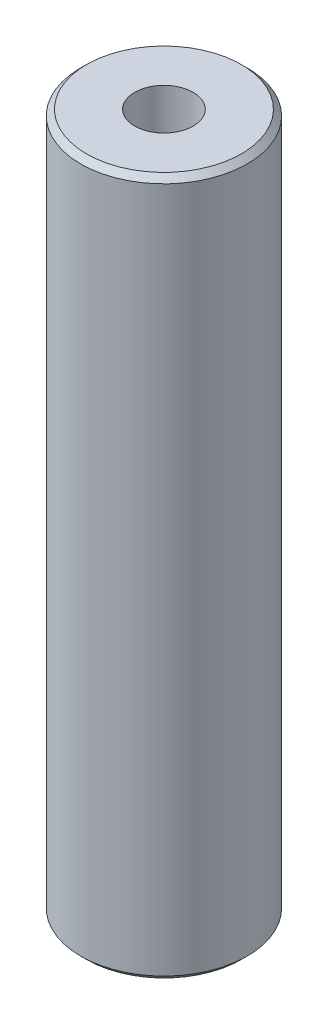
ISO-10303-21;
HEADER;
FILE_DESCRIPTION(('STEP AP214'),'2;1');
FILE_NAME('part.step','',(''),(''),'','','');
FILE_SCHEMA(('AUTOMOTIVE_DESIGN { 1 0 10303 214 1 1 1 1 }'));
ENDSEC;
DATA;
#1=APPLICATION_CONTEXT('core data for automotive mechanical design processes');
#2=APPLICATION_PROTOCOL_DEFINITION('international standard','automotive_design',2000,#1);
#3=PRODUCT_CONTEXT('',#1,'mechanical');
#4=PRODUCT('Part','Part','',(#3));
#5=PRODUCT_RELATED_PRODUCT_CATEGORY('part','',(#4));
#6=PRODUCT_DEFINITION_FORMATION('','',#4);
#7=PRODUCT_DEFINITION_CONTEXT('part definition',#1,'design');
#8=PRODUCT_DEFINITION('design','',#6,#7);
#9=PRODUCT_DEFINITION_SHAPE('','',#8);
#10=(LENGTH_UNIT() NAMED_UNIT(*) SI_UNIT(.MILLI.,.METRE.));
#11=(NAMED_UNIT(*) PLANE_ANGLE_UNIT() SI_UNIT($,.RADIAN.));
#12=(NAMED_UNIT(*) SI_UNIT($,.STERADIAN.) SOLID_ANGLE_UNIT());
#13=UNCERTAINTY_MEASURE_WITH_UNIT(LENGTH_MEASURE(1.E-05),#10,'distance_accuracy_value','');
#14=(GEOMETRIC_REPRESENTATION_CONTEXT(3) GLOBAL_UNCERTAINTY_ASSIGNED_CONTEXT((#13)) GLOBAL_UNIT_ASSIGNED_CONTEXT((#10,
#11,#12)) REPRESENTATION_CONTEXT('',''));
#15=CARTESIAN_POINT('',(0.,0.,0.));
#16=DIRECTION('',(0.,0.,1.));
#17=DIRECTION('',(1.,0.,0.));
#18=AXIS2_PLACEMENT_3D('',#15,#16,#17);
#19=CARTESIAN_POINT('',(0.,461.053021340718,0.));
#20=DIRECTION('',(0.,-1.,0.));
#21=DIRECTION('',(0.,0.,-1.));
#22=AXIS2_PLACEMENT_3D('',#19,#20,#21);
#23=CYLINDRICAL_SURFACE('',#22,55.);
#24=CARTESIAN_POINT('',(0.,457.217049437386,0.));
#25=DIRECTION('',(0.,1.,0.));
#26=DIRECTION('',(0.,0.,1.));
#27=AXIS2_PLACEMENT_3D('',#24,#25,#26);
#28=CIRCLE('',#27,55.);
#29=CARTESIAN_POINT('',(0.,457.217049437386,55.));
#30=VERTEX_POINT('',#29);
#31=EDGE_CURVE('E50',#30,#30,#28,.F.);
#32=ORIENTED_EDGE('',*,*,#31,.T.);
#33=EDGE_LOOP('',(#32));
#34=FACE_BOUND('',#33,.T.);
#35=CARTESIAN_POINT('',(0.,3.8359719033319,0.));
#36=DIRECTION('',(0.,1.,0.));
#37=DIRECTION('',(0.,0.,1.));
#38=AXIS2_PLACEMENT_3D('',#35,#36,#37);
#39=CIRCLE('',#38,55.);
#40=CARTESIAN_POINT('',(0.,3.8359719033319,55.));
#41=VERTEX_POINT('',#40);
#42=EDGE_CURVE('E51',#41,#41,#39,.T.);
#43=ORIENTED_EDGE('',*,*,#42,.T.);
#44=EDGE_LOOP('',(#43));
#45=FACE_BOUND('',#44,.T.);
#46=ADVANCED_FACE('F39',(#34,#45),#23,.T.);
#47=CARTESIAN_POINT('',(0.,461.053021340718,0.));
#48=DIRECTION('',(0.,1.,0.));
#49=DIRECTION('',(0.,0.,1.));
#50=AXIS2_PLACEMENT_3D('',#47,#48,#49);
#51=PLANE('',#50);
#52=CARTESIAN_POINT('',(0.,461.053021340718,0.));
#53=DIRECTION('',(0.,1.,0.));
#54=DIRECTION('',(0.,0.,1.));
#55=AXIS2_PLACEMENT_3D('',#52,#53,#54);
#56=CIRCLE('',#55,51.164028096668);
#57=CARTESIAN_POINT('',(0.,461.053021340718,51.164028096668));
#58=VERTEX_POINT('',#57);
#59=EDGE_CURVE('E54',#58,#58,#56,.T.);
#60=ORIENTED_EDGE('',*,*,#59,.T.);
#61=EDGE_LOOP('',(#60));
#62=FACE_BOUND('',#61,.T.);
#63=CARTESIAN_POINT('',(0.,461.053021340718,0.));
#64=DIRECTION('',(0.,1.,0.));
#65=DIRECTION('',(0.,0.,1.));
#66=AXIS2_PLACEMENT_3D('',#63,#64,#65);
#67=CIRCLE('',#66,19.332226736109);
#68=CARTESIAN_POINT('',(0.,461.053021340718,19.332226736109));
#69=VERTEX_POINT('',#68);
#70=EDGE_CURVE('E58',#69,#69,#67,.T.);
#71=ORIENTED_EDGE('',*,*,#70,.F.);
#72=EDGE_LOOP('',(#71));
#73=FACE_BOUND('',#72,.T.);
#74=ADVANCED_FACE('F69',(#62,#73),#51,.T.);
#75=CARTESIAN_POINT('',(0.,0.,0.));
#76=DIRECTION('',(0.,1.,0.));
#77=DIRECTION('',(0.,0.,1.));
#78=AXIS2_PLACEMENT_3D('',#75,#76,#77);
#79=PLANE('',#78);
#80=CARTESIAN_POINT('',(0.,0.,0.));
#81=DIRECTION('',(0.,1.,0.));
#82=DIRECTION('',(0.,0.,1.));
#83=AXIS2_PLACEMENT_3D('',#80,#81,#82);
#84=CIRCLE('',#83,51.1640280966681);
#85=CARTESIAN_POINT('',(0.,0.,51.1640280966681));
#86=VERTEX_POINT('',#85);
#87=EDGE_CURVE('E10',#86,#86,#84,.F.);
#88=ORIENTED_EDGE('',*,*,#87,.T.);
#89=EDGE_LOOP('',(#88));
#90=FACE_BOUND('',#89,.T.);
#91=CARTESIAN_POINT('',(0.,0.,0.));
#92=DIRECTION('',(0.,1.,0.));
#93=DIRECTION('',(0.,0.,1.));
#94=AXIS2_PLACEMENT_3D('',#91,#92,#93);
#95=CIRCLE('',#94,19.332226736109);
#96=CARTESIAN_POINT('',(0.,0.,19.332226736109));
#97=VERTEX_POINT('',#96);
#98=EDGE_CURVE('E63',#97,#97,#95,.T.);
#99=ORIENTED_EDGE('',*,*,#98,.T.);
#100=EDGE_LOOP('',(#99));
#101=FACE_BOUND('',#100,.T.);
#102=ADVANCED_FACE('F75',(#90,#101),#79,.F.);
#103=CARTESIAN_POINT('',(0.,461.053021340718,0.));
#104=DIRECTION('',(0.,-1.,0.));
#105=DIRECTION('',(0.,0.,-1.));
#106=AXIS2_PLACEMENT_3D('',#103,#104,#105);
#107=CYLINDRICAL_SURFACE('',#106,19.332226736109);
#108=ORIENTED_EDGE('',*,*,#70,.T.);
#109=EDGE_LOOP('',(#108));
#110=FACE_BOUND('',#109,.T.);
#111=ORIENTED_EDGE('',*,*,#98,.F.);
#112=EDGE_LOOP('',(#111));
#113=FACE_BOUND('',#112,.T.);
#114=ADVANCED_FACE('F70',(#110,#113),#107,.F.);
#115=CARTESIAN_POINT('',(0.,461.053021340718,0.));
#116=DIRECTION('',(0.,-1.,0.));
#117=DIRECTION('',(0.,0.,-1.));
#118=AXIS2_PLACEMENT_3D('',#115,#116,#117);
#119=CONICAL_SURFACE('',#118,51.164028096668,0.785398163397442);
#120=ORIENTED_EDGE('',*,*,#31,.F.);
#121=EDGE_LOOP('',(#120));
#122=FACE_BOUND('',#121,.T.);
#123=ORIENTED_EDGE('',*,*,#59,.F.);
#124=EDGE_LOOP('',(#123));
#125=FACE_BOUND('',#124,.T.);
#126=ADVANCED_FACE('F81',(#122,#125),#119,.T.);
#127=CARTESIAN_POINT('',(0.,3.8359719033319,0.));
#128=DIRECTION('',(0.,1.,0.));
#129=DIRECTION('',(0.,0.,1.));
#130=AXIS2_PLACEMENT_3D('',#127,#128,#129);
#131=CONICAL_SURFACE('',#130,55.,0.785398163397449);
#132=ORIENTED_EDGE('',*,*,#87,.F.);
#133=EDGE_LOOP('',(#132));
#134=FACE_BOUND('',#133,.T.);
#135=ORIENTED_EDGE('',*,*,#42,.F.);
#136=EDGE_LOOP('',(#135));
#137=FACE_BOUND('',#136,.T.);
#138=ADVANCED_FACE('F45',(#134,#137),#131,.T.);
#139=CLOSED_SHELL('',(#46,#74,#102,#114,#126,#138));
#140=MANIFOLD_SOLID_BREP('B2',#139);
#141=ADVANCED_BREP_SHAPE_REPRESENTATION('',(#18,#140),#14);
#142=SHAPE_DEFINITION_REPRESENTATION(#9,#141);
ENDSEC;
END-ISO-10303-21;
